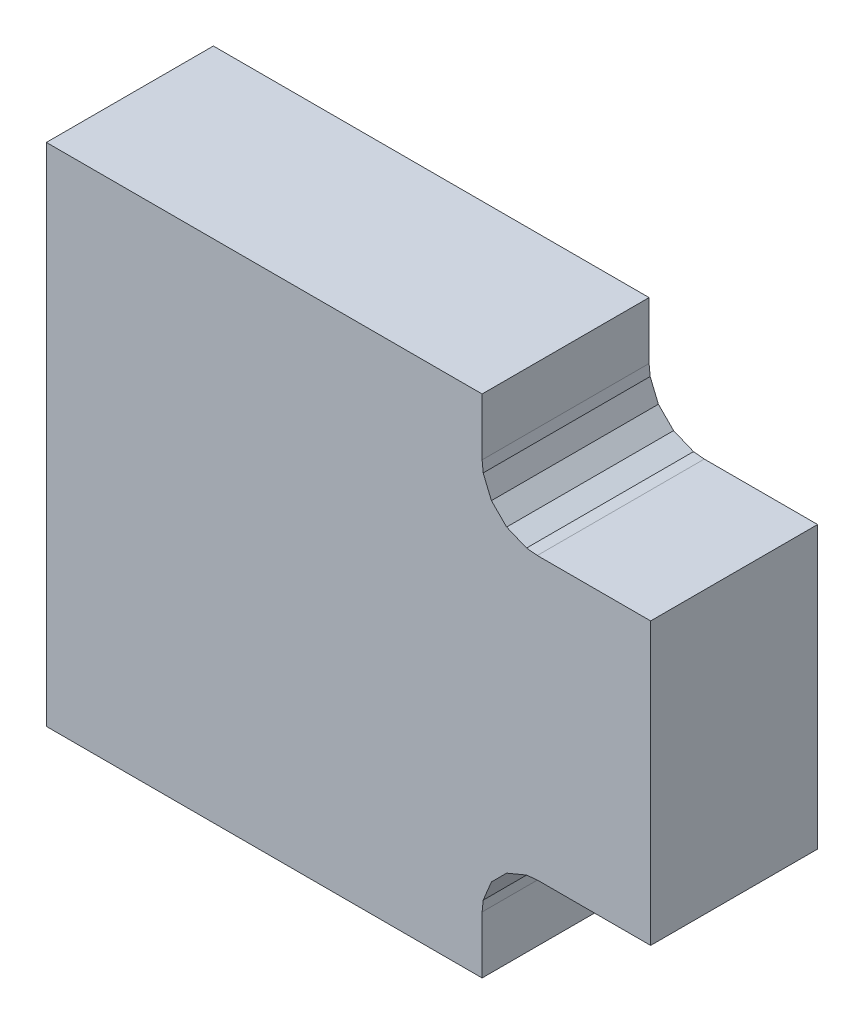
ISO-10303-21;
HEADER;
FILE_DESCRIPTION(('STEP AP214'),'2;1');
FILE_NAME('part.step','',(''),(''),'','','');
FILE_SCHEMA(('AUTOMOTIVE_DESIGN { 1 0 10303 214 1 1 1 1 }'));
ENDSEC;
DATA;
#1=APPLICATION_CONTEXT('core data for automotive mechanical design processes');
#2=APPLICATION_PROTOCOL_DEFINITION('international standard','automotive_design',2000,#1);
#3=PRODUCT_CONTEXT('',#1,'mechanical');
#4=PRODUCT('Part','Part','',(#3));
#5=PRODUCT_RELATED_PRODUCT_CATEGORY('part','',(#4));
#6=PRODUCT_DEFINITION_FORMATION('','',#4);
#7=PRODUCT_DEFINITION_CONTEXT('part definition',#1,'design');
#8=PRODUCT_DEFINITION('design','',#6,#7);
#9=PRODUCT_DEFINITION_SHAPE('','',#8);
#10=(LENGTH_UNIT() NAMED_UNIT(*) SI_UNIT(.MILLI.,.METRE.));
#11=(NAMED_UNIT(*) PLANE_ANGLE_UNIT() SI_UNIT($,.RADIAN.));
#12=(NAMED_UNIT(*) SI_UNIT($,.STERADIAN.) SOLID_ANGLE_UNIT());
#13=UNCERTAINTY_MEASURE_WITH_UNIT(LENGTH_MEASURE(1.E-05),#10,'distance_accuracy_value','');
#14=(GEOMETRIC_REPRESENTATION_CONTEXT(3) GLOBAL_UNCERTAINTY_ASSIGNED_CONTEXT((#13)) GLOBAL_UNIT_ASSIGNED_CONTEXT((#10,
#11,#12)) REPRESENTATION_CONTEXT('',''));
#15=CARTESIAN_POINT('',(0.,0.,0.));
#16=DIRECTION('',(0.,0.,1.));
#17=DIRECTION('',(1.,0.,0.));
#18=AXIS2_PLACEMENT_3D('',#15,#16,#17);
#19=CARTESIAN_POINT('',(-0.01813628636958,1.404925790028E-05,0.1499997));
#20=DIRECTION('',(0.,0.,-1.));
#21=DIRECTION('',(0.,-1.,0.));
#22=AXIS2_PLACEMENT_3D('',#19,#20,#21);
#23=PLANE('',#22);
#24=DIRECTION('',(-0.0978501403290349,-0.995201160588947,0.));
#25=VECTOR('',#24,1.);
#26=CARTESIAN_POINT('',(0.12097004,-0.16613378,0.1499997));
#27=LINE('',#26,#25);
#28=CARTESIAN_POINT('',(0.12097004,-0.16613378,0.1499997));
#29=VERTEX_POINT('',#28);
#30=CARTESIAN_POINT('',(0.120017498844446,-0.175823026860958,0.1499997));
#31=VERTEX_POINT('',#30);
#32=EDGE_CURVE('E139',#29,#31,#27,.T.);
#33=ORIENTED_EDGE('',*,*,#32,.F.);
#34=DIRECTION('',(-0.382687575673026,-0.923877816286062,0.));
#35=VECTOR('',#34,1.);
#36=CARTESIAN_POINT('',(0.1283843,-0.1482344,0.1499997));
#37=LINE('',#36,#35);
#38=CARTESIAN_POINT('',(0.1283843,-0.1482344,0.1499997));
#39=VERTEX_POINT('',#38);
#40=EDGE_CURVE('E133',#39,#29,#37,.T.);
#41=ORIENTED_EDGE('',*,*,#40,.F.);
#42=DIRECTION('',(-0.707106781185048,-0.707106781188048,0.));
#43=VECTOR('',#42,1.);
#44=CARTESIAN_POINT('',(0.1420876,-0.1345311,0.1499997));
#45=LINE('',#44,#43);
#46=CARTESIAN_POINT('',(0.1420876,-0.1345311,0.1499997));
#47=VERTEX_POINT('',#46);
#48=EDGE_CURVE('E137',#47,#39,#45,.T.);
#49=ORIENTED_EDGE('',*,*,#48,.F.);
#50=DIRECTION('',(-0.923877816287269,-0.382687575670111,0.));
#51=VECTOR('',#50,1.);
#52=CARTESIAN_POINT('',(0.15998698,-0.12711684,0.1499997));
#53=LINE('',#52,#51);
#54=CARTESIAN_POINT('',(0.15998698,-0.12711684,0.1499997));
#55=VERTEX_POINT('',#54);
#56=EDGE_CURVE('E288',#55,#47,#53,.T.);
#57=ORIENTED_EDGE('',*,*,#56,.F.);
#58=DIRECTION('',(-0.995178228331261,-0.0980830966856857,0.));
#59=VECTOR('',#58,1.);
#60=CARTESIAN_POINT('',(0.16967708,-0.1261618,0.1499997));
#61=LINE('',#60,#59);
#62=CARTESIAN_POINT('',(0.16967708,-0.1261618,0.1499997));
#63=VERTEX_POINT('',#62);
#64=EDGE_CURVE('E212',#63,#55,#61,.T.);
#65=ORIENTED_EDGE('',*,*,#64,.F.);
#66=DIRECTION('',(-1.,0.,0.));
#67=VECTOR('',#66,1.);
#68=CARTESIAN_POINT('',(0.27141424,-0.1261618,0.1499997));
#69=LINE('',#68,#67);
#70=CARTESIAN_POINT('',(0.27141424,-0.1261618,0.1499997));
#71=VERTEX_POINT('',#70);
#72=EDGE_CURVE('E255',#71,#63,#69,.T.);
#73=ORIENTED_EDGE('',*,*,#72,.F.);
#74=DIRECTION('',(0.,-1.,0.));
#75=VECTOR('',#74,1.);
#76=CARTESIAN_POINT('',(0.27141424,0.1263269,0.1499997));
#77=LINE('',#76,#75);
#78=CARTESIAN_POINT('',(0.27141424,0.1263269,0.1499997));
#79=VERTEX_POINT('',#78);
#80=EDGE_CURVE('E218',#79,#71,#77,.T.);
#81=ORIENTED_EDGE('',*,*,#80,.F.);
#82=DIRECTION('',(1.,0.,0.));
#83=VECTOR('',#82,1.);
#84=CARTESIAN_POINT('',(0.16959834,0.1263269,0.1499997));
#85=LINE('',#84,#83);
#86=CARTESIAN_POINT('',(0.16959834,0.1263269,0.1499997));
#87=VERTEX_POINT('',#86);
#88=EDGE_CURVE('E203',#87,#79,#85,.T.);
#89=ORIENTED_EDGE('',*,*,#88,.F.);
#90=DIRECTION('',(0.995188644472653,-0.0979773540808458,0.));
#91=VECTOR('',#90,1.);
#92=CARTESIAN_POINT('',(0.15992348,0.1272794,0.1499997));
#93=LINE('',#92,#91);
#94=CARTESIAN_POINT('',(0.15992348,0.1272794,0.1499997));
#95=VERTEX_POINT('',#94);
#96=EDGE_CURVE('E169',#95,#87,#93,.T.);
#97=ORIENTED_EDGE('',*,*,#96,.F.);
#98=DIRECTION('',(0.923898409011878,-0.382637857281949,0.));
#99=VECTOR('',#98,1.);
#100=CARTESIAN_POINT('',(0.14205204,0.13468096,0.1499997));
#101=LINE('',#100,#99);
#102=CARTESIAN_POINT('',(0.14205204,0.13468096,0.1499997));
#103=VERTEX_POINT('',#102);
#104=EDGE_CURVE('E262',#103,#95,#101,.T.);
#105=ORIENTED_EDGE('',*,*,#104,.F.);
#106=DIRECTION('',(0.707106781186548,-0.707106781186548,0.));
#107=VECTOR('',#106,1.);
#108=CARTESIAN_POINT('',(0.1283716,0.1483614,0.1499997));
#109=LINE('',#108,#107);
#110=CARTESIAN_POINT('',(0.1283716,0.1483614,0.1499997));
#111=VERTEX_POINT('',#110);
#112=EDGE_CURVE('E198',#111,#103,#109,.T.);
#113=ORIENTED_EDGE('',*,*,#112,.F.);
#114=DIRECTION('',(0.382637857284864,-0.923898409010671,0.));
#115=VECTOR('',#114,1.);
#116=CARTESIAN_POINT('',(0.12097004,0.16623284,0.1499997));
#117=LINE('',#116,#115);
#118=CARTESIAN_POINT('',(0.12097004,0.16623284,0.1499997));
#119=VERTEX_POINT('',#118);
#120=EDGE_CURVE('E175',#119,#111,#117,.T.);
#121=ORIENTED_EDGE('',*,*,#120,.F.);
#122=DIRECTION('',(0.0979773540746063,-0.995188644473267,0.));
#123=VECTOR('',#122,1.);
#124=CARTESIAN_POINT('',(0.12001754,0.1759077,0.1499997));
#125=LINE('',#124,#123);
#126=CARTESIAN_POINT('',(0.12001754,0.1759077,0.1499997));
#127=VERTEX_POINT('',#126);
#128=EDGE_CURVE('E234',#127,#119,#125,.T.);
#129=ORIENTED_EDGE('',*,*,#128,.F.);
#130=DIRECTION('',(0.,-1.,0.));
#131=VECTOR('',#130,1.);
#132=CARTESIAN_POINT('',(0.12001754,0.2271776,0.1499997));
#133=LINE('',#132,#131);
#134=CARTESIAN_POINT('',(0.12001754,0.2271776,0.1499997));
#135=VERTEX_POINT('',#134);
#136=EDGE_CURVE('E181',#135,#127,#133,.T.);
#137=ORIENTED_EDGE('',*,*,#136,.F.);
#138=DIRECTION('',(1.,0.,0.));
#139=VECTOR('',#138,1.);
#140=CARTESIAN_POINT('',(-0.27141424,0.2271776,0.1499997));
#141=LINE('',#140,#139);
#142=CARTESIAN_POINT('',(-0.27141424,0.2271776,0.1499997));
#143=VERTEX_POINT('',#142);
#144=EDGE_CURVE('E226',#143,#135,#141,.T.);
#145=ORIENTED_EDGE('',*,*,#144,.F.);
#146=DIRECTION('',(0.,1.,0.));
#147=VECTOR('',#146,1.);
#148=CARTESIAN_POINT('',(-0.27141424,-0.22717506,0.1499997));
#149=LINE('',#148,#147);
#150=CARTESIAN_POINT('',(-0.27141424,-0.22717506,0.1499997));
#151=VERTEX_POINT('',#150);
#152=EDGE_CURVE('E197',#151,#143,#149,.T.);
#153=ORIENTED_EDGE('',*,*,#152,.F.);
#154=DIRECTION('',(-1.,0.,0.));
#155=VECTOR('',#154,1.);
#156=CARTESIAN_POINT('',(0.12001754,-0.22717506,0.1499997));
#157=LINE('',#156,#155);
#158=CARTESIAN_POINT('',(0.12001754,-0.22717506,0.1499997));
#159=VERTEX_POINT('',#158);
#160=EDGE_CURVE('E27',#159,#151,#157,.T.);
#161=ORIENTED_EDGE('',*,*,#160,.F.);
#162=DIRECTION('',(0.,-1.,0.));
#163=VECTOR('',#162,1.);
#164=CARTESIAN_POINT('',(0.12001754,-0.17582388,0.1499997));
#165=LINE('',#164,#163);
#166=EDGE_CURVE('E191',#31,#159,#165,.T.);
#167=ORIENTED_EDGE('',*,*,#166,.F.);
#168=EDGE_LOOP('',(#33,#41,#49,#57,#65,#73,#81,#89,#97,#105,#113,#121,#129,#137,#145,#153,#161,#167));
#169=FACE_BOUND('',#168,.T.);
#170=ADVANCED_FACE('F16',(#169),#23,.F.);
#171=CARTESIAN_POINT('',(-0.01813628636958,1.404925790028E-05,0.));
#172=DIRECTION('',(0.,0.,-1.));
#173=DIRECTION('',(0.,-1.,0.));
#174=AXIS2_PLACEMENT_3D('',#171,#172,#173);
#175=PLANE('',#174);
#176=DIRECTION('',(0.,-1.,0.));
#177=VECTOR('',#176,1.);
#178=CARTESIAN_POINT('',(0.12001754,-0.17582388,0.));
#179=LINE('',#178,#177);
#180=CARTESIAN_POINT('',(0.120017498668471,-0.175823030449169,0.));
#181=VERTEX_POINT('',#180);
#182=CARTESIAN_POINT('',(0.12001754,-0.22717506,0.));
#183=VERTEX_POINT('',#182);
#184=EDGE_CURVE('E217',#181,#183,#179,.T.);
#185=ORIENTED_EDGE('',*,*,#184,.T.);
#186=DIRECTION('',(-1.,0.,0.));
#187=VECTOR('',#186,1.);
#188=CARTESIAN_POINT('',(0.12001754,-0.22717506,0.));
#189=LINE('',#188,#187);
#190=CARTESIAN_POINT('',(-0.27141424,-0.22717506,0.));
#191=VERTEX_POINT('',#190);
#192=EDGE_CURVE('E11',#183,#191,#189,.T.);
#193=ORIENTED_EDGE('',*,*,#192,.T.);
#194=DIRECTION('',(0.,1.,0.));
#195=VECTOR('',#194,1.);
#196=CARTESIAN_POINT('',(-0.27141424,-0.22717506,0.));
#197=LINE('',#196,#195);
#198=CARTESIAN_POINT('',(-0.27141424,0.2271776,0.));
#199=VERTEX_POINT('',#198);
#200=EDGE_CURVE('E231',#191,#199,#197,.T.);
#201=ORIENTED_EDGE('',*,*,#200,.T.);
#202=DIRECTION('',(1.,0.,0.));
#203=VECTOR('',#202,1.);
#204=CARTESIAN_POINT('',(-0.27141424,0.2271776,0.));
#205=LINE('',#204,#203);
#206=CARTESIAN_POINT('',(0.12001754,0.2271776,0.));
#207=VERTEX_POINT('',#206);
#208=EDGE_CURVE('E186',#199,#207,#205,.T.);
#209=ORIENTED_EDGE('',*,*,#208,.T.);
#210=DIRECTION('',(0.,-1.,0.));
#211=VECTOR('',#210,1.);
#212=CARTESIAN_POINT('',(0.12001754,0.2271776,0.));
#213=LINE('',#212,#211);
#214=CARTESIAN_POINT('',(0.12001754,0.1759077,0.));
#215=VERTEX_POINT('',#214);
#216=EDGE_CURVE('E237',#207,#215,#213,.T.);
#217=ORIENTED_EDGE('',*,*,#216,.T.);
#218=DIRECTION('',(0.0979773540746063,-0.995188644473267,0.));
#219=VECTOR('',#218,1.);
#220=CARTESIAN_POINT('',(0.12001754,0.1759077,0.));
#221=LINE('',#220,#219);
#222=CARTESIAN_POINT('',(0.12097004,0.16623284,0.));
#223=VERTEX_POINT('',#222);
#224=EDGE_CURVE('E171',#215,#223,#221,.T.);
#225=ORIENTED_EDGE('',*,*,#224,.T.);
#226=DIRECTION('',(0.382637857284864,-0.923898409010671,0.));
#227=VECTOR('',#226,1.);
#228=CARTESIAN_POINT('',(0.12097004,0.16623284,0.));
#229=LINE('',#228,#227);
#230=CARTESIAN_POINT('',(0.1283716,0.1483614,0.));
#231=VERTEX_POINT('',#230);
#232=EDGE_CURVE('E20',#223,#231,#229,.T.);
#233=ORIENTED_EDGE('',*,*,#232,.T.);
#234=DIRECTION('',(0.707106781186548,-0.707106781186548,0.));
#235=VECTOR('',#234,1.);
#236=CARTESIAN_POINT('',(0.1283716,0.1483614,0.));
#237=LINE('',#236,#235);
#238=CARTESIAN_POINT('',(0.14205204,0.13468096,0.));
#239=VERTEX_POINT('',#238);
#240=EDGE_CURVE('E258',#231,#239,#237,.T.);
#241=ORIENTED_EDGE('',*,*,#240,.T.);
#242=DIRECTION('',(0.923898409011878,-0.382637857281949,0.));
#243=VECTOR('',#242,1.);
#244=CARTESIAN_POINT('',(0.14205204,0.13468096,0.));
#245=LINE('',#244,#243);
#246=CARTESIAN_POINT('',(0.15992348,0.1272794,0.));
#247=VERTEX_POINT('',#246);
#248=EDGE_CURVE('E180',#239,#247,#245,.T.);
#249=ORIENTED_EDGE('',*,*,#248,.T.);
#250=DIRECTION('',(0.995188644472653,-0.0979773540808458,0.));
#251=VECTOR('',#250,1.);
#252=CARTESIAN_POINT('',(0.15992348,0.1272794,0.));
#253=LINE('',#252,#251);
#254=CARTESIAN_POINT('',(0.16959834,0.1263269,0.));
#255=VERTEX_POINT('',#254);
#256=EDGE_CURVE('E168',#247,#255,#253,.T.);
#257=ORIENTED_EDGE('',*,*,#256,.T.);
#258=DIRECTION('',(1.,0.,0.));
#259=VECTOR('',#258,1.);
#260=CARTESIAN_POINT('',(0.16959834,0.1263269,0.));
#261=LINE('',#260,#259);
#262=CARTESIAN_POINT('',(0.27141424,0.1263269,0.));
#263=VERTEX_POINT('',#262);
#264=EDGE_CURVE('E223',#255,#263,#261,.T.);
#265=ORIENTED_EDGE('',*,*,#264,.T.);
#266=DIRECTION('',(0.,-1.,0.));
#267=VECTOR('',#266,1.);
#268=CARTESIAN_POINT('',(0.27141424,0.1263269,0.));
#269=LINE('',#268,#267);
#270=CARTESIAN_POINT('',(0.27141424,-0.1261618,0.));
#271=VERTEX_POINT('',#270);
#272=EDGE_CURVE('E270',#263,#271,#269,.T.);
#273=ORIENTED_EDGE('',*,*,#272,.T.);
#274=DIRECTION('',(-1.,0.,0.));
#275=VECTOR('',#274,1.);
#276=CARTESIAN_POINT('',(0.27141424,-0.1261618,0.));
#277=LINE('',#276,#275);
#278=CARTESIAN_POINT('',(0.16967708,-0.1261618,0.));
#279=VERTEX_POINT('',#278);
#280=EDGE_CURVE('E208',#271,#279,#277,.T.);
#281=ORIENTED_EDGE('',*,*,#280,.T.);
#282=DIRECTION('',(-0.995178228331261,-0.0980830966856857,0.));
#283=VECTOR('',#282,1.);
#284=CARTESIAN_POINT('',(0.16967708,-0.1261618,0.));
#285=LINE('',#284,#283);
#286=CARTESIAN_POINT('',(0.15998698,-0.12711684,0.));
#287=VERTEX_POINT('',#286);
#288=EDGE_CURVE('E281',#279,#287,#285,.T.);
#289=ORIENTED_EDGE('',*,*,#288,.T.);
#290=DIRECTION('',(-0.923877816287269,-0.382687575670111,0.));
#291=VECTOR('',#290,1.);
#292=CARTESIAN_POINT('',(0.15998698,-0.12711684,0.));
#293=LINE('',#292,#291);
#294=CARTESIAN_POINT('',(0.1420876,-0.1345311,0.));
#295=VERTEX_POINT('',#294);
#296=EDGE_CURVE('E157',#287,#295,#293,.T.);
#297=ORIENTED_EDGE('',*,*,#296,.T.);
#298=DIRECTION('',(-0.707106781185048,-0.707106781188048,0.));
#299=VECTOR('',#298,1.);
#300=CARTESIAN_POINT('',(0.1420876,-0.1345311,0.));
#301=LINE('',#300,#299);
#302=CARTESIAN_POINT('',(0.1283843,-0.1482344,0.));
#303=VERTEX_POINT('',#302);
#304=EDGE_CURVE('E126',#295,#303,#301,.T.);
#305=ORIENTED_EDGE('',*,*,#304,.T.);
#306=DIRECTION('',(-0.382687575673026,-0.923877816286062,0.));
#307=VECTOR('',#306,1.);
#308=CARTESIAN_POINT('',(0.1283843,-0.1482344,0.));
#309=LINE('',#308,#307);
#310=CARTESIAN_POINT('',(0.12097004,-0.16613378,0.));
#311=VERTEX_POINT('',#310);
#312=EDGE_CURVE('E149',#303,#311,#309,.T.);
#313=ORIENTED_EDGE('',*,*,#312,.T.);
#314=DIRECTION('',(-0.0978501403290349,-0.995201160588947,0.));
#315=VECTOR('',#314,1.);
#316=CARTESIAN_POINT('',(0.12097004,-0.16613378,0.));
#317=LINE('',#316,#315);
#318=EDGE_CURVE('E187',#311,#181,#317,.T.);
#319=ORIENTED_EDGE('',*,*,#318,.T.);
#320=EDGE_LOOP('',(#185,#193,#201,#209,#217,#225,#233,#241,#249,#257,#265,#273,#281,#289,#297,
#305,#313,#319));
#321=FACE_BOUND('',#320,.T.);
#322=ADVANCED_FACE('F346',(#321),#175,.T.);
#323=CARTESIAN_POINT('',(0.12001754,-0.22717506,0.));
#324=DIRECTION('',(0.,-1.,0.));
#325=DIRECTION('',(0.,0.,-1.));
#326=AXIS2_PLACEMENT_3D('',#323,#324,#325);
#327=PLANE('',#326);
#328=DIRECTION('',(0.,0.,1.));
#329=VECTOR('',#328,1.);
#330=CARTESIAN_POINT('',(0.12001754,-0.22717506,0.));
#331=LINE('',#330,#329);
#332=EDGE_CURVE('E214',#183,#159,#331,.T.);
#333=ORIENTED_EDGE('',*,*,#332,.T.);
#334=ORIENTED_EDGE('',*,*,#160,.T.);
#335=DIRECTION('',(0.,0.,1.));
#336=VECTOR('',#335,1.);
#337=CARTESIAN_POINT('',(-0.27141424,-0.22717506,0.));
#338=LINE('',#337,#336);
#339=EDGE_CURVE('E193',#191,#151,#338,.T.);
#340=ORIENTED_EDGE('',*,*,#339,.F.);
#341=ORIENTED_EDGE('',*,*,#192,.F.);
#342=EDGE_LOOP('',(#333,#334,#340,#341));
#343=FACE_BOUND('',#342,.T.);
#344=ADVANCED_FACE('F427',(#343),#327,.T.);
#345=CARTESIAN_POINT('',(0.12001754,-0.17582388,0.));
#346=DIRECTION('',(1.,0.,0.));
#347=DIRECTION('',(0.,1.,0.));
#348=AXIS2_PLACEMENT_3D('',#345,#346,#347);
#349=PLANE('',#348);
#350=DIRECTION('',(0.,0.,1.));
#351=VECTOR('',#350,1.);
#352=CARTESIAN_POINT('',(0.12001754,-0.17582388,0.));
#353=LINE('',#352,#351);
#354=EDGE_CURVE('E192',#181,#31,#353,.T.);
#355=ORIENTED_EDGE('',*,*,#354,.T.);
#356=ORIENTED_EDGE('',*,*,#166,.T.);
#357=ORIENTED_EDGE('',*,*,#332,.F.);
#358=ORIENTED_EDGE('',*,*,#184,.F.);
#359=EDGE_LOOP('',(#355,#356,#357,#358));
#360=FACE_BOUND('',#359,.T.);
#361=ADVANCED_FACE('F429',(#360),#349,.T.);
#362=CARTESIAN_POINT('',(0.12097004,-0.16613378,0.));
#363=DIRECTION('',(0.995201160588947,-0.0978501403290349,0.));
#364=DIRECTION('',(0.,0.,-1.));
#365=AXIS2_PLACEMENT_3D('',#362,#363,#364);
#366=PLANE('',#365);
#367=DIRECTION('',(0.,0.,1.));
#368=VECTOR('',#367,1.);
#369=CARTESIAN_POINT('',(0.12097004,-0.16613378,0.));
#370=LINE('',#369,#368);
#371=EDGE_CURVE('E144',#311,#29,#370,.T.);
#372=ORIENTED_EDGE('',*,*,#371,.T.);
#373=ORIENTED_EDGE('',*,*,#32,.T.);
#374=ORIENTED_EDGE('',*,*,#354,.F.);
#375=ORIENTED_EDGE('',*,*,#318,.F.);
#376=EDGE_LOOP('',(#372,#373,#374,#375));
#377=FACE_BOUND('',#376,.T.);
#378=ADVANCED_FACE('F343',(#377),#366,.T.);
#379=CARTESIAN_POINT('',(0.1283843,-0.1482344,0.));
#380=DIRECTION('',(0.923877816286062,-0.382687575673026,0.));
#381=DIRECTION('',(0.,0.,-1.));
#382=AXIS2_PLACEMENT_3D('',#379,#380,#381);
#383=PLANE('',#382);
#384=DIRECTION('',(0.,0.,1.));
#385=VECTOR('',#384,1.);
#386=CARTESIAN_POINT('',(0.1283843,-0.1482344,0.));
#387=LINE('',#386,#385);
#388=EDGE_CURVE('E146',#303,#39,#387,.T.);
#389=ORIENTED_EDGE('',*,*,#388,.T.);
#390=ORIENTED_EDGE('',*,*,#40,.T.);
#391=ORIENTED_EDGE('',*,*,#371,.F.);
#392=ORIENTED_EDGE('',*,*,#312,.F.);
#393=EDGE_LOOP('',(#389,#390,#391,#392));
#394=FACE_BOUND('',#393,.T.);
#395=ADVANCED_FACE('F147',(#394),#383,.T.);
#396=CARTESIAN_POINT('',(0.1420876,-0.1345311,0.));
#397=DIRECTION('',(0.707106781188048,-0.707106781185048,0.));
#398=DIRECTION('',(0.,0.,-1.));
#399=AXIS2_PLACEMENT_3D('',#396,#397,#398);
#400=PLANE('',#399);
#401=DIRECTION('',(0.,0.,1.));
#402=VECTOR('',#401,1.);
#403=CARTESIAN_POINT('',(0.1420876,-0.1345311,0.));
#404=LINE('',#403,#402);
#405=EDGE_CURVE('E154',#295,#47,#404,.T.);
#406=ORIENTED_EDGE('',*,*,#405,.T.);
#407=ORIENTED_EDGE('',*,*,#48,.T.);
#408=ORIENTED_EDGE('',*,*,#388,.F.);
#409=ORIENTED_EDGE('',*,*,#304,.F.);
#410=EDGE_LOOP('',(#406,#407,#408,#409));
#411=FACE_BOUND('',#410,.T.);
#412=ADVANCED_FACE('F152',(#411),#400,.T.);
#413=CARTESIAN_POINT('',(0.15998698,-0.12711684,0.));
#414=DIRECTION('',(0.382687575670111,-0.923877816287269,0.));
#415=DIRECTION('',(0.,0.,-1.));
#416=AXIS2_PLACEMENT_3D('',#413,#414,#415);
#417=PLANE('',#416);
#418=DIRECTION('',(0.,0.,1.));
#419=VECTOR('',#418,1.);
#420=CARTESIAN_POINT('',(0.15998698,-0.12711684,0.));
#421=LINE('',#420,#419);
#422=EDGE_CURVE('E277',#287,#55,#421,.T.);
#423=ORIENTED_EDGE('',*,*,#422,.T.);
#424=ORIENTED_EDGE('',*,*,#56,.T.);
#425=ORIENTED_EDGE('',*,*,#405,.F.);
#426=ORIENTED_EDGE('',*,*,#296,.F.);
#427=EDGE_LOOP('',(#423,#424,#425,#426));
#428=FACE_BOUND('',#427,.T.);
#429=ADVANCED_FACE('F351',(#428),#417,.T.);
#430=CARTESIAN_POINT('',(0.16967708,-0.1261618,0.));
#431=DIRECTION('',(0.0980830966856857,-0.995178228331261,0.));
#432=DIRECTION('',(0.,0.,-1.));
#433=AXIS2_PLACEMENT_3D('',#430,#431,#432);
#434=PLANE('',#433);
#435=DIRECTION('',(0.,0.,1.));
#436=VECTOR('',#435,1.);
#437=CARTESIAN_POINT('',(0.16967708,-0.1261618,0.));
#438=LINE('',#437,#436);
#439=EDGE_CURVE('E213',#279,#63,#438,.T.);
#440=ORIENTED_EDGE('',*,*,#439,.T.);
#441=ORIENTED_EDGE('',*,*,#64,.T.);
#442=ORIENTED_EDGE('',*,*,#422,.F.);
#443=ORIENTED_EDGE('',*,*,#288,.F.);
#444=EDGE_LOOP('',(#440,#441,#442,#443));
#445=FACE_BOUND('',#444,.T.);
#446=ADVANCED_FACE('F448',(#445),#434,.T.);
#447=CARTESIAN_POINT('',(0.27141424,-0.1261618,0.));
#448=DIRECTION('',(0.,-1.,0.));
#449=DIRECTION('',(0.,0.,-1.));
#450=AXIS2_PLACEMENT_3D('',#447,#448,#449);
#451=PLANE('',#450);
#452=DIRECTION('',(0.,0.,1.));
#453=VECTOR('',#452,1.);
#454=CARTESIAN_POINT('',(0.27141424,-0.1261618,0.));
#455=LINE('',#454,#453);
#456=EDGE_CURVE('E222',#271,#71,#455,.T.);
#457=ORIENTED_EDGE('',*,*,#456,.T.);
#458=ORIENTED_EDGE('',*,*,#72,.T.);
#459=ORIENTED_EDGE('',*,*,#439,.F.);
#460=ORIENTED_EDGE('',*,*,#280,.F.);
#461=EDGE_LOOP('',(#457,#458,#459,#460));
#462=FACE_BOUND('',#461,.T.);
#463=ADVANCED_FACE('F450',(#462),#451,.T.);
#464=CARTESIAN_POINT('',(0.27141424,0.1263269,0.));
#465=DIRECTION('',(1.,0.,0.));
#466=DIRECTION('',(0.,1.,0.));
#467=AXIS2_PLACEMENT_3D('',#464,#465,#466);
#468=PLANE('',#467);
#469=DIRECTION('',(0.,0.,1.));
#470=VECTOR('',#469,1.);
#471=CARTESIAN_POINT('',(0.27141424,0.1263269,0.));
#472=LINE('',#471,#470);
#473=EDGE_CURVE('E207',#263,#79,#472,.T.);
#474=ORIENTED_EDGE('',*,*,#473,.T.);
#475=ORIENTED_EDGE('',*,*,#80,.T.);
#476=ORIENTED_EDGE('',*,*,#456,.F.);
#477=ORIENTED_EDGE('',*,*,#272,.F.);
#478=EDGE_LOOP('',(#474,#475,#476,#477));
#479=FACE_BOUND('',#478,.T.);
#480=ADVANCED_FACE('F453',(#479),#468,.T.);
#481=CARTESIAN_POINT('',(0.16959834,0.1263269,0.));
#482=DIRECTION('',(0.,1.,0.));
#483=DIRECTION('',(1.,0.,0.));
#484=AXIS2_PLACEMENT_3D('',#481,#482,#483);
#485=PLANE('',#484);
#486=DIRECTION('',(0.,0.,1.));
#487=VECTOR('',#486,1.);
#488=CARTESIAN_POINT('',(0.16959834,0.1263269,0.));
#489=LINE('',#488,#487);
#490=EDGE_CURVE('E165',#255,#87,#489,.T.);
#491=ORIENTED_EDGE('',*,*,#490,.T.);
#492=ORIENTED_EDGE('',*,*,#88,.T.);
#493=ORIENTED_EDGE('',*,*,#473,.F.);
#494=ORIENTED_EDGE('',*,*,#264,.F.);
#495=EDGE_LOOP('',(#491,#492,#493,#494));
#496=FACE_BOUND('',#495,.T.);
#497=ADVANCED_FACE('F471',(#496),#485,.T.);
#498=CARTESIAN_POINT('',(0.15992348,0.1272794,0.));
#499=DIRECTION('',(0.0979773540808458,0.995188644472653,0.));
#500=DIRECTION('',(0.,0.,-1.));
#501=AXIS2_PLACEMENT_3D('',#498,#499,#500);
#502=PLANE('',#501);
#503=DIRECTION('',(0.,0.,1.));
#504=VECTOR('',#503,1.);
#505=CARTESIAN_POINT('',(0.15992348,0.1272794,0.));
#506=LINE('',#505,#504);
#507=EDGE_CURVE('E266',#247,#95,#506,.T.);
#508=ORIENTED_EDGE('',*,*,#507,.T.);
#509=ORIENTED_EDGE('',*,*,#96,.T.);
#510=ORIENTED_EDGE('',*,*,#490,.F.);
#511=ORIENTED_EDGE('',*,*,#256,.F.);
#512=EDGE_LOOP('',(#508,#509,#510,#511));
#513=FACE_BOUND('',#512,.T.);
#514=ADVANCED_FACE('F467',(#513),#502,.T.);
#515=CARTESIAN_POINT('',(0.14205204,0.13468096,0.));
#516=DIRECTION('',(0.382637857281949,0.923898409011878,0.));
#517=DIRECTION('',(0.,0.,-1.));
#518=AXIS2_PLACEMENT_3D('',#515,#516,#517);
#519=PLANE('',#518);
#520=DIRECTION('',(0.,0.,1.));
#521=VECTOR('',#520,1.);
#522=CARTESIAN_POINT('',(0.14205204,0.13468096,0.));
#523=LINE('',#522,#521);
#524=EDGE_CURVE('E202',#239,#103,#523,.T.);
#525=ORIENTED_EDGE('',*,*,#524,.T.);
#526=ORIENTED_EDGE('',*,*,#104,.T.);
#527=ORIENTED_EDGE('',*,*,#507,.F.);
#528=ORIENTED_EDGE('',*,*,#248,.F.);
#529=EDGE_LOOP('',(#525,#526,#527,#528));
#530=FACE_BOUND('',#529,.T.);
#531=ADVANCED_FACE('F470',(#530),#519,.T.);
#532=CARTESIAN_POINT('',(0.1283716,0.1483614,0.));
#533=DIRECTION('',(0.707106781186548,0.707106781186548,0.));
#534=DIRECTION('',(0.,0.,-1.));
#535=AXIS2_PLACEMENT_3D('',#532,#533,#534);
#536=PLANE('',#535);
#537=DIRECTION('',(0.,0.,1.));
#538=VECTOR('',#537,1.);
#539=CARTESIAN_POINT('',(0.1283716,0.1483614,0.));
#540=LINE('',#539,#538);
#541=EDGE_CURVE('E246',#231,#111,#540,.T.);
#542=ORIENTED_EDGE('',*,*,#541,.T.);
#543=ORIENTED_EDGE('',*,*,#112,.T.);
#544=ORIENTED_EDGE('',*,*,#524,.F.);
#545=ORIENTED_EDGE('',*,*,#240,.F.);
#546=EDGE_LOOP('',(#542,#543,#544,#545));
#547=FACE_BOUND('',#546,.T.);
#548=ADVANCED_FACE('F397',(#547),#536,.T.);
#549=CARTESIAN_POINT('',(0.12097004,0.16623284,0.));
#550=DIRECTION('',(0.923898409010671,0.382637857284864,0.));
#551=DIRECTION('',(0.,0.,-1.));
#552=AXIS2_PLACEMENT_3D('',#549,#550,#551);
#553=PLANE('',#552);
#554=DIRECTION('',(0.,0.,1.));
#555=VECTOR('',#554,1.);
#556=CARTESIAN_POINT('',(0.12097004,0.16623284,0.));
#557=LINE('',#556,#555);
#558=EDGE_CURVE('E176',#223,#119,#557,.T.);
#559=ORIENTED_EDGE('',*,*,#558,.T.);
#560=ORIENTED_EDGE('',*,*,#120,.T.);
#561=ORIENTED_EDGE('',*,*,#541,.F.);
#562=ORIENTED_EDGE('',*,*,#232,.F.);
#563=EDGE_LOOP('',(#559,#560,#561,#562));
#564=FACE_BOUND('',#563,.T.);
#565=ADVANCED_FACE('F18',(#564),#553,.T.);
#566=CARTESIAN_POINT('',(0.12001754,0.1759077,0.));
#567=DIRECTION('',(0.995188644473267,0.0979773540746063,0.));
#568=DIRECTION('',(0.,0.,-1.));
#569=AXIS2_PLACEMENT_3D('',#566,#567,#568);
#570=PLANE('',#569);
#571=DIRECTION('',(0.,0.,1.));
#572=VECTOR('',#571,1.);
#573=CARTESIAN_POINT('',(0.12001754,0.1759077,0.));
#574=LINE('',#573,#572);
#575=EDGE_CURVE('E185',#215,#127,#574,.T.);
#576=ORIENTED_EDGE('',*,*,#575,.T.);
#577=ORIENTED_EDGE('',*,*,#128,.T.);
#578=ORIENTED_EDGE('',*,*,#558,.F.);
#579=ORIENTED_EDGE('',*,*,#224,.F.);
#580=EDGE_LOOP('',(#576,#577,#578,#579));
#581=FACE_BOUND('',#580,.T.);
#582=ADVANCED_FACE('F461',(#581),#570,.T.);
#583=CARTESIAN_POINT('',(0.12001754,0.2271776,0.));
#584=DIRECTION('',(1.,0.,0.));
#585=DIRECTION('',(0.,1.,0.));
#586=AXIS2_PLACEMENT_3D('',#583,#584,#585);
#587=PLANE('',#586);
#588=DIRECTION('',(0.,0.,1.));
#589=VECTOR('',#588,1.);
#590=CARTESIAN_POINT('',(0.12001754,0.2271776,0.));
#591=LINE('',#590,#589);
#592=EDGE_CURVE('E230',#207,#135,#591,.T.);
#593=ORIENTED_EDGE('',*,*,#592,.T.);
#594=ORIENTED_EDGE('',*,*,#136,.T.);
#595=ORIENTED_EDGE('',*,*,#575,.F.);
#596=ORIENTED_EDGE('',*,*,#216,.F.);
#597=EDGE_LOOP('',(#593,#594,#595,#596));
#598=FACE_BOUND('',#597,.T.);
#599=ADVANCED_FACE('F459',(#598),#587,.T.);
#600=CARTESIAN_POINT('',(-0.27141424,0.2271776,0.));
#601=DIRECTION('',(0.,1.,0.));
#602=DIRECTION('',(1.,0.,0.));
#603=AXIS2_PLACEMENT_3D('',#600,#601,#602);
#604=PLANE('',#603);
#605=DIRECTION('',(0.,0.,1.));
#606=VECTOR('',#605,1.);
#607=CARTESIAN_POINT('',(-0.27141424,0.2271776,0.));
#608=LINE('',#607,#606);
#609=EDGE_CURVE('E242',#199,#143,#608,.T.);
#610=ORIENTED_EDGE('',*,*,#609,.T.);
#611=ORIENTED_EDGE('',*,*,#144,.T.);
#612=ORIENTED_EDGE('',*,*,#592,.F.);
#613=ORIENTED_EDGE('',*,*,#208,.F.);
#614=EDGE_LOOP('',(#610,#611,#612,#613));
#615=FACE_BOUND('',#614,.T.);
#616=ADVANCED_FACE('F421',(#615),#604,.T.);
#617=CARTESIAN_POINT('',(-0.27141424,-0.22717506,0.));
#618=DIRECTION('',(-1.,0.,0.));
#619=DIRECTION('',(0.,0.,1.));
#620=AXIS2_PLACEMENT_3D('',#617,#618,#619);
#621=PLANE('',#620);
#622=ORIENTED_EDGE('',*,*,#339,.T.);
#623=ORIENTED_EDGE('',*,*,#152,.T.);
#624=ORIENTED_EDGE('',*,*,#609,.F.);
#625=ORIENTED_EDGE('',*,*,#200,.F.);
#626=EDGE_LOOP('',(#622,#623,#624,#625));
#627=FACE_BOUND('',#626,.T.);
#628=ADVANCED_FACE('F425',(#627),#621,.T.);
#629=CLOSED_SHELL('',(#170,#322,#344,#361,#378,#395,#412,#429,#446,#463,#480,#497,#514,#531,
#548,#565,#582,#599,#616,#628));
#630=MANIFOLD_SOLID_BREP('B1',#629);
#631=ADVANCED_BREP_SHAPE_REPRESENTATION('',(#18,#630),#14);
#632=SHAPE_DEFINITION_REPRESENTATION(#9,#631);
ENDSEC;
END-ISO-10303-21;
